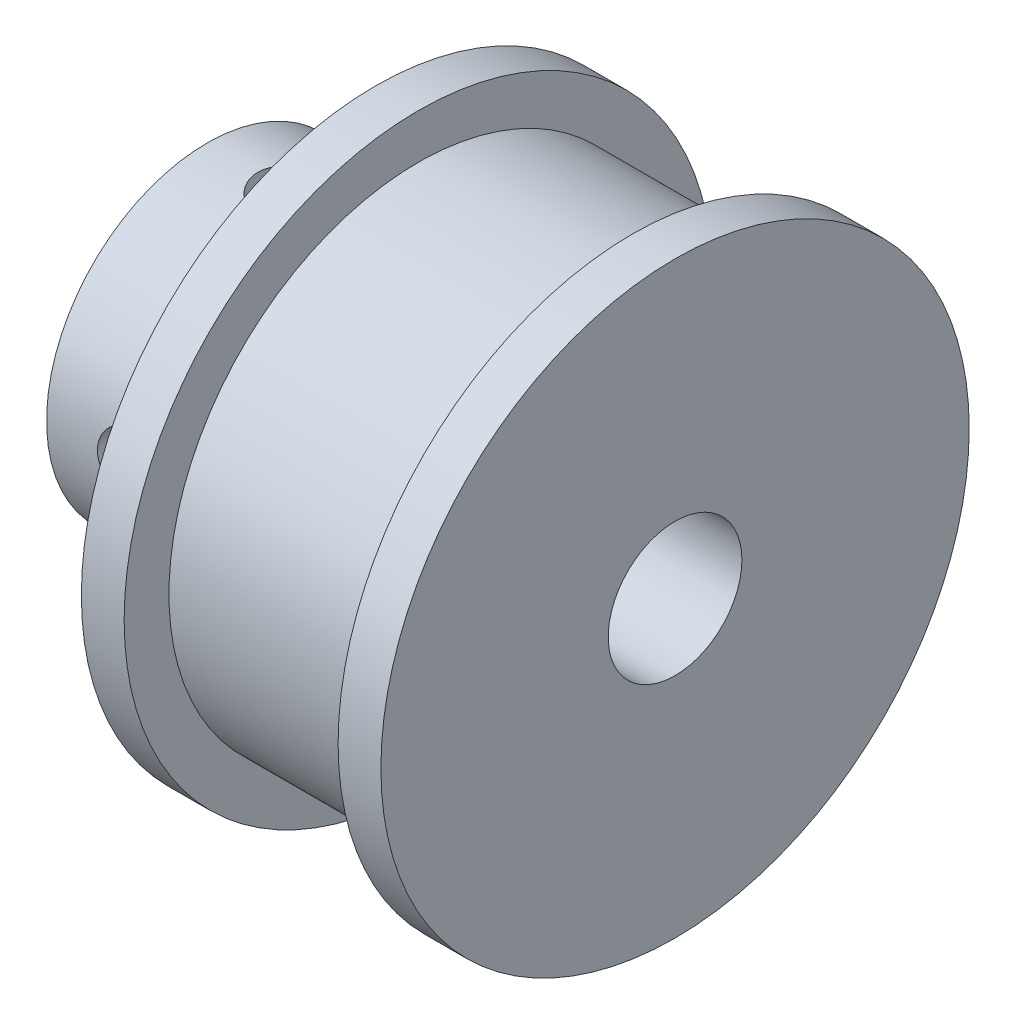
ISO-10303-21;
HEADER;
FILE_DESCRIPTION(('STEP AP214'),'2;1');
FILE_NAME('part.step','',(''),(''),'','','');
FILE_SCHEMA(('AUTOMOTIVE_DESIGN { 1 0 10303 214 1 1 1 1 }'));
ENDSEC;
DATA;
#1=APPLICATION_CONTEXT('core data for automotive mechanical design processes');
#2=APPLICATION_PROTOCOL_DEFINITION('international standard','automotive_design',2000,#1);
#3=PRODUCT_CONTEXT('',#1,'mechanical');
#4=PRODUCT('Part','Part','',(#3));
#5=PRODUCT_RELATED_PRODUCT_CATEGORY('part','',(#4));
#6=PRODUCT_DEFINITION_FORMATION('','',#4);
#7=PRODUCT_DEFINITION_CONTEXT('part definition',#1,'design');
#8=PRODUCT_DEFINITION('design','',#6,#7);
#9=PRODUCT_DEFINITION_SHAPE('','',#8);
#10=(LENGTH_UNIT() NAMED_UNIT(*) SI_UNIT(.MILLI.,.METRE.));
#11=(NAMED_UNIT(*) PLANE_ANGLE_UNIT() SI_UNIT($,.RADIAN.));
#12=(NAMED_UNIT(*) SI_UNIT($,.STERADIAN.) SOLID_ANGLE_UNIT());
#13=UNCERTAINTY_MEASURE_WITH_UNIT(LENGTH_MEASURE(1.E-05),#10,'distance_accuracy_value','');
#14=(GEOMETRIC_REPRESENTATION_CONTEXT(3) GLOBAL_UNCERTAINTY_ASSIGNED_CONTEXT((#13)) GLOBAL_UNIT_ASSIGNED_CONTEXT((#10,
#11,#12)) REPRESENTATION_CONTEXT('',''));
#15=CARTESIAN_POINT('',(0.,0.,0.));
#16=DIRECTION('',(0.,0.,1.));
#17=DIRECTION('',(1.,0.,0.));
#18=AXIS2_PLACEMENT_3D('',#15,#16,#17);
#19=CARTESIAN_POINT('',(0.,0.,0.));
#20=DIRECTION('',(1.,0.,0.));
#21=DIRECTION('',(0.,0.,-1.));
#22=AXIS2_PLACEMENT_3D('',#19,#20,#21);
#23=CYLINDRICAL_SURFACE('',#22,2.5);
#24=CARTESIAN_POINT('',(1.90000000000001,0.,2.5));
#25=CARTESIAN_POINT('',(1.90000412789938,0.0657149536912328,2.49999641755189));
#26=CARTESIAN_POINT('',(1.9052125914021,0.13150824962254,2.49738113774397));
#27=CARTESIAN_POINT('',(1.92581610042616,0.26115029408553,2.48717695046745));
#28=CARTESIAN_POINT('',(1.94123049124707,0.324995108391878,2.4795785978623));
#29=CARTESIAN_POINT('',(1.981492260771,0.448666931100716,2.4602034925414));
#30=CARTESIAN_POINT('',(2.00630298031002,0.508508503673972,2.448442989719));
#31=CARTESIAN_POINT('',(2.06446327670618,0.623090771008203,2.42182220644723));
#32=CARTESIAN_POINT('',(2.09781218031107,0.677831867487559,2.40696217041913));
#33=CARTESIAN_POINT('',(2.17439656185663,0.784384772202395,2.37445322822571));
#34=CARTESIAN_POINT('',(2.21810809904956,0.835819013902635,2.3566899890942));
#35=CARTESIAN_POINT('',(2.3131518490588,0.930974306083717,2.32074962808431));
#36=CARTESIAN_POINT('',(2.36448981471556,0.974689478883453,2.30257220261294));
#37=CARTESIAN_POINT('',(2.47810418690423,1.05656500056284,2.26623688996684));
#38=CARTESIAN_POINT('',(2.5409201229324,1.09403166943954,2.24818983712665));
#39=CARTESIAN_POINT('',(2.67295916998277,1.15771028361336,2.21607473465401));
#40=CARTESIAN_POINT('',(2.74217766090344,1.18393026870791,2.20200384508737));
#41=CARTESIAN_POINT('',(2.88083138177741,1.22266555273573,2.18072333797261));
#42=CARTESIAN_POINT('',(2.95000556508425,1.23590732135054,2.17315339479642));
#43=CARTESIAN_POINT('',(3.08997354722435,1.25053374163605,2.1647736243566));
#44=CARTESIAN_POINT('',(3.16076567608894,1.25193011046634,2.16395711679111));
#45=CARTESIAN_POINT('',(3.29285753039421,1.24335910896536,2.16888662821561));
#46=CARTESIAN_POINT('',(3.35428003902881,1.23473069942102,2.17385954577517));
#47=CARTESIAN_POINT('',(3.4746523867163,1.20867481132116,2.18845285917313));
#48=CARTESIAN_POINT('',(3.53360143163164,1.19124452987206,2.19807473539721));
#49=CARTESIAN_POINT('',(3.64903641570707,1.1477622254825,2.22109345515927));
#50=CARTESIAN_POINT('',(3.70543299848223,1.12151883389499,2.23457300829999));
#51=CARTESIAN_POINT('',(3.81329286573751,1.061302109585,2.26379255351755));
#52=CARTESIAN_POINT('',(3.86475391950011,1.02732530476558,2.27953355975239));
#53=CARTESIAN_POINT('',(3.96815156592903,0.947582568640978,2.31391447379108));
#54=CARTESIAN_POINT('',(4.01932109197019,0.900868072961595,2.33266887795933));
#55=CARTESIAN_POINT('',(4.11341927323862,0.799444473426711,2.36934529125509));
#56=CARTESIAN_POINT('',(4.15634399004235,0.744731570717851,2.38726689948501));
#57=CARTESIAN_POINT('',(4.23460707628715,0.625645632289805,2.42127484103705));
#58=CARTESIAN_POINT('',(4.26950059055717,0.560941989499256,2.43723730202509));
#59=CARTESIAN_POINT('',(4.32762128630376,0.425582769360992,2.46447351401553));
#60=CARTESIAN_POINT('',(4.35085773126895,0.354931970331592,2.47575098679441));
#61=CARTESIAN_POINT('',(4.38309425464584,0.215958114575874,2.49155417176795));
#62=CARTESIAN_POINT('',(4.39311404468347,0.147926913185403,2.4965617287664));
#63=CARTESIAN_POINT('',(4.40183091391811,0.0109744999366904,2.50091266823877));
#64=CARTESIAN_POINT('',(4.40053335704934,-0.0579462748373779,2.5002587340164));
#65=CARTESIAN_POINT('',(4.38724163947655,-0.189041214982493,2.49363990316801));
#66=CARTESIAN_POINT('',(4.37608433408746,-0.251324260062443,2.48809057110237));
#67=CARTESIAN_POINT('',(4.34470241013114,-0.373008615377396,2.47277714143524));
#68=CARTESIAN_POINT('',(4.32447679193329,-0.432409607113745,2.46301257917916));
#69=CARTESIAN_POINT('',(4.27500191695853,-0.54861076056208,2.43980314267087));
#70=CARTESIAN_POINT('',(4.24551118735398,-0.60528799625769,2.42626102212424));
#71=CARTESIAN_POINT('',(4.17861558044244,-0.713076702123649,2.39679967896386));
#72=CARTESIAN_POINT('',(4.1412073317582,-0.7641857872191,2.38087944457232));
#73=CARTESIAN_POINT('',(4.0552994683339,-0.864709611613313,2.34635276671831));
#74=CARTESIAN_POINT('',(4.00607141443304,-0.913465097280795,2.32763606060552));
#75=CARTESIAN_POINT('',(3.90009356091336,-1.00232040139155,2.29077989504843));
#76=CARTESIAN_POINT('',(3.84333860147953,-1.04241423211355,2.27264084226908));
#77=CARTESIAN_POINT('',(3.72044543224961,-1.11463489312211,2.23813990282585));
#78=CARTESIAN_POINT('',(3.65398591723925,-1.14628186984829,2.2219066207934));
#79=CARTESIAN_POINT('',(3.51561241538434,-1.19760353251725,2.19467590460158));
#80=CARTESIAN_POINT('',(3.44370559187351,-1.21729364485946,2.18367172800773));
#81=CARTESIAN_POINT('',(3.30386222142319,-1.24232710931209,2.16951876260834));
#82=CARTESIAN_POINT('',(3.2362071832137,-1.24886624550107,2.16571729325615));
#83=CARTESIAN_POINT('',(3.10069116603659,-1.25086144297598,2.16456693307719));
#84=CARTESIAN_POINT('',(3.03283028907571,-1.24632230828049,2.16721524534441));
#85=CARTESIAN_POINT('',(2.90564562308498,-1.22740765699032,2.17797327562531));
#86=CARTESIAN_POINT('',(2.8461244123195,-1.21401039292849,2.18553868102993));
#87=CARTESIAN_POINT('',(2.73023985071912,-1.1789691977808,2.20463770234897));
#88=CARTESIAN_POINT('',(2.67387752238504,-1.15732261394975,2.21617259462095));
#89=CARTESIAN_POINT('',(2.56171893626674,-1.10476968162585,2.24285662955661));
#90=CARTESIAN_POINT('',(2.50621512271288,-1.07333892227056,2.25819652995239));
#91=CARTESIAN_POINT('',(2.40090682977427,-1.00268871454578,2.29044164543238));
#92=CARTESIAN_POINT('',(2.35110533685189,-0.963465214048302,2.30734767243153));
#93=CARTESIAN_POINT('',(2.25232252205298,-0.872754158330794,2.34327903949142));
#94=CARTESIAN_POINT('',(2.2041761220476,-0.820355528762706,2.36231229139336));
#95=CARTESIAN_POINT('',(2.11717127072046,-0.707693507775342,2.3984719031886));
#96=CARTESIAN_POINT('',(2.07831782571714,-0.647425904070974,2.4155972326005));
#97=CARTESIAN_POINT('',(2.01095454654725,-0.519914496024927,2.44622511981379));
#98=CARTESIAN_POINT('',(1.98251978823571,-0.452624379918261,2.45970120703636));
#99=CARTESIAN_POINT('',(1.93773979010132,-0.313427626617733,2.48126676704332));
#100=CARTESIAN_POINT('',(1.92136019146304,-0.241534749528952,2.48937154216165));
#101=CARTESIAN_POINT('',(1.9076282361552,-0.140752433104225,2.49619327387079));
#102=CARTESIAN_POINT('',(1.90477169892048,-0.112702349299369,2.49761706674002));
#103=CARTESIAN_POINT('',(1.900956668104,-0.0564396647589448,2.49952121222331));
#104=CARTESIAN_POINT('',(1.89999822691101,-0.0282270595592256,2.50000153879704));
#105=CARTESIAN_POINT('',(1.90000000000001,0.,2.5));
#106=B_SPLINE_CURVE_WITH_KNOTS('',3,(#24,#25,#26,#27,#28,#29,#30,#31,#32,#33,#34,#35,#36,#37,
#38,#39,#40,#41,#42,#43,#44,#45,#46,#47,#48,#49,#50,#51,#52,#53,#54,#55,#56,#57,#58,#59,#60,#61,
#62,#63,#64,#65,#66,#67,#68,#69,#70,#71,#72,#73,#74,#75,#76,#77,#78,#79,#80,#81,#82,#83,#84,#85,
#86,#87,#88,#89,#90,#91,#92,#93,#94,#95,#96,#97,#98,#99,#100,#101,#102,#103,#104,#105),
.UNSPECIFIED.,.T.,.F.,(4,2,2,2,2,2,2,2,2,2,2,2,2,2,2,2,2,2,2,2,2,2,2,2,2,2,2,2,2,2,2,2,2,2,2,2,
2,2,2,2,4),(0.,0.197030321775365,0.394435187136495,0.59107769436537,0.787704700726955,
0.996227198397605,1.20490779706754,1.4297715803844,1.6544743487285,1.86572515175286,
2.07676696661274,2.26257140511649,2.44843504907097,2.63862800210608,2.82890651575276,
3.04331176667346,3.25781918248356,3.48228777768049,3.70657771140347,3.9122911308918,
4.11790705639343,4.3075863313265,4.49728652038662,4.6924107003487,4.88761813435421,
5.10199513305521,5.31651985769287,5.54143352699589,5.76605639925969,5.96911634372963,
6.17208824825003,6.35572412805224,6.53941910979594,6.73545570969514,6.93159451423693,
7.15156553440619,7.37165479220712,7.59330017078652,7.81431135781158,7.89894100172117,
7.98357298143554),.UNSPECIFIED.);
#107=CARTESIAN_POINT('',(1.90000000000001,0.,2.5));
#108=VERTEX_POINT('',#107);
#109=EDGE_CURVE('E3643',#108,#108,#106,.T.);
#110=ORIENTED_EDGE('',*,*,#109,.F.);
#111=EDGE_LOOP('',(#110));
#112=FACE_BOUND('',#111,.T.);
#113=CARTESIAN_POINT('',(3.15,2.1650635094611,-1.25));
#114=CARTESIAN_POINT('',(3.21513476024406,2.16506918410574,-1.24999545384316));
#115=CARTESIAN_POINT('',(3.28035176440631,2.16804751484696,-1.24487496341652));
#116=CARTESIAN_POINT('',(3.40878408084644,2.17952958065066,-1.22465401237257));
#117=CARTESIAN_POINT('',(3.47199489380426,2.18804492569449,-1.20953258069272));
#118=CARTESIAN_POINT('',(3.59431458042993,2.20936683256748,-1.17012493587476));
#119=CARTESIAN_POINT('',(3.65344331559198,2.22215054341565,-1.14588744061716));
#120=CARTESIAN_POINT('',(3.7667802524959,2.25053331021072,-1.08908440672046));
#121=CARTESIAN_POINT('',(3.82098818782807,2.26613251845081,-1.05651841754472));
#122=CARTESIAN_POINT('',(3.92788216069688,2.29996086321802,-0.980833175663597));
#123=CARTESIAN_POINT('',(3.98007391959193,2.31830079547442,-0.937065045179712));
#124=CARTESIAN_POINT('',(4.07676048550839,2.35464978482132,-0.841567259518084));
#125=CARTESIAN_POINT('',(4.1212514532294,2.37265867289062,-0.789833657227865));
#126=CARTESIAN_POINT('',(4.20420893893458,2.40776846191186,-0.675611954268182));
#127=CARTESIAN_POINT('',(4.24206720982441,2.42472633022716,-0.612633986265718));
#128=CARTESIAN_POINT('',(4.3064260665572,2.45438445124411,-0.480196283249379));
#129=CARTESIAN_POINT('',(4.33293382017146,2.46708738979677,-0.410740672672693));
#130=CARTESIAN_POINT('',(4.37188082662637,2.48600576555297,-0.272556179907471));
#131=CARTESIAN_POINT('',(4.38518690794442,2.49261850276115,-0.204127238111022));
#132=CARTESIAN_POINT('',(4.4002076483438,2.50009479807584,-0.0657132858723104));
#133=CARTESIAN_POINT('',(4.40192932099464,2.50096183480737,0.00427075730467285));
#134=CARTESIAN_POINT('',(4.39406665753706,2.49703727395563,0.137290655529687));
#135=CARTESIAN_POINT('',(4.38545248059847,2.49273119865201,0.200401498970989));
#136=CARTESIAN_POINT('',(4.35889894511918,2.47967806574684,0.324142214897902));
#137=CARTESIAN_POINT('',(4.34095888877972,2.47093067582992,0.384771901367406));
#138=CARTESIAN_POINT('',(4.29614679238773,2.44964479109568,0.502886739461941));
#139=CARTESIAN_POINT('',(4.26915460853492,2.43705551911499,0.560316779393972));
#140=CARTESIAN_POINT('',(4.20717072974813,2.40922057483359,0.66997100189166));
#141=CARTESIAN_POINT('',(4.17217617087206,2.39397395196855,0.722193311048306));
#142=CARTESIAN_POINT('',(4.09138081058373,2.36055492999037,0.825217076122743));
#143=CARTESIAN_POINT('',(4.04487121459249,2.34224219997719,0.8754175937867));
#144=CARTESIAN_POINT('',(3.94426284383728,2.30567925733515,0.967630462872224));
#145=CARTESIAN_POINT('',(3.89015828465742,2.28742910332036,1.00963651446779));
#146=CARTESIAN_POINT('',(3.77168975946989,2.25180195115606,1.08688166830276));
#147=CARTESIAN_POINT('',(3.70689247118224,2.23455399988385,1.12152164372256));
#148=CARTESIAN_POINT('',(3.57132791080125,2.2046931284822,1.17914889125154));
#149=CARTESIAN_POINT('',(3.50056695872805,2.19207537557584,1.20214832276361));
#150=CARTESIAN_POINT('',(3.36098186089651,2.17430794771293,1.2339752637813));
#151=CARTESIAN_POINT('',(3.29244860119556,2.16864569810621,1.24378140264997));
#152=CARTESIAN_POINT('',(3.15449832310432,2.16397399202012,1.25189618326428));
#153=CARTESIAN_POINT('',(3.08508196360027,2.1649598361164,1.25021294664378));
#154=CARTESIAN_POINT('',(2.95543260177659,2.17292920675731,1.23629505417996));
#155=CARTESIAN_POINT('',(2.89502568611509,2.17924484383318,1.22523477089058));
#156=CARTESIAN_POINT('',(2.7770402671613,2.19617526939177,1.19462035579055));
#157=CARTESIAN_POINT('',(2.71946268656674,2.20679145006292,1.17506347327952));
#158=CARTESIAN_POINT('',(2.60573583637163,2.23170277599571,1.12705948575611));
#159=CARTESIAN_POINT('',(2.54977622893306,2.24614554053829,1.0982425796159));
#160=CARTESIAN_POINT('',(2.44316341057626,2.27695149371562,1.03285883001975));
#161=CARTESIAN_POINT('',(2.3925129456084,2.29331566693935,0.996288005415269));
#162=CARTESIAN_POINT('',(2.29127654059557,2.3285999807042,0.911046458998566));
#163=CARTESIAN_POINT('',(2.24150356160293,2.34758228942861,0.861431590393707));
#164=CARTESIAN_POINT('',(2.15073470250801,2.38417793722366,0.754255619247859));
#165=CARTESIAN_POINT('',(2.10974178721183,2.40179081259637,0.696691843319182));
#166=CARTESIAN_POINT('',(2.03678284256238,2.43426702113696,0.573169203198445));
#167=CARTESIAN_POINT('',(2.00508360223636,2.44904552090037,0.50702887196764));
#168=CARTESIAN_POINT('',(1.95357762017826,2.47354193699126,0.369402955801352));
#169=CARTESIAN_POINT('',(1.93376043579212,2.48326429595466,0.297922126740219));
#170=CARTESIAN_POINT('',(1.90828929478168,2.49584385227353,0.158724602913021));
#171=CARTESIAN_POINT('',(1.90150265515486,2.49924909885239,0.0912643048130704));
#172=CARTESIAN_POINT('',(1.898945918182,2.50052662968914,-0.0439074824390051));
#173=CARTESIAN_POINT('',(1.90317196434555,2.49840085083612,-0.111618875368859));
#174=CARTESIAN_POINT('',(1.92177050849453,2.48917461047403,-0.240672490396434));
#175=CARTESIAN_POINT('',(1.93545606157209,2.48241118334987,-0.30214039726408));
#176=CARTESIAN_POINT('',(1.97165874912872,2.46490117079279,-0.421807440229522));
#177=CARTESIAN_POINT('',(1.99417715011682,2.45415401415995,-0.480006106194386));
#178=CARTESIAN_POINT('',(2.04840881520747,2.4290741343515,-0.594279257806106));
#179=CARTESIAN_POINT('',(2.0804741540098,2.41460771498499,-0.650156428375058));
#180=CARTESIAN_POINT('',(2.15244741357382,2.38360166427283,-0.755968302267531));
#181=CARTESIAN_POINT('',(2.19235893639459,2.36706108197951,-0.805900259268634));
#182=CARTESIAN_POINT('',(2.28349642377838,2.33160762783285,-0.903642505196113));
#183=CARTESIAN_POINT('',(2.33545310934649,2.31262248764622,-0.950747105674089));
#184=CARTESIAN_POINT('',(2.44681340141222,2.27578845203566,-1.03582910924334));
#185=CARTESIAN_POINT('',(2.50622352608461,2.25794057202332,-1.07379843751257));
#186=CARTESIAN_POINT('',(2.6332958082262,2.22499506631145,-1.14053884973207));
#187=CARTESIAN_POINT('',(2.70115941391092,2.21000217820338,-1.16898133245117));
#188=CARTESIAN_POINT('',(2.84166550542472,2.1858269541044,-1.21359838688301));
#189=CARTESIAN_POINT('',(2.91429111114086,2.17662520184628,-1.22981398896918));
#190=CARTESIAN_POINT('',(3.014756694565,2.16911590752238,-1.24295875983052));
#191=CARTESIAN_POINT('',(3.04170986799736,2.1676016125644,-1.24559513120481));
#192=CARTESIAN_POINT('',(3.09577060085281,2.16557419859688,-1.24911675636245));
#193=CARTESIAN_POINT('',(3.12287817048234,2.16506114656387,-1.25000189299984));
#194=CARTESIAN_POINT('',(3.15,2.1650635094611,-1.25));
#195=B_SPLINE_CURVE_WITH_KNOTS('',3,(#113,#114,#115,#116,#117,#118,#119,#120,#121,#122,#123,
#124,#125,#126,#127,#128,#129,#130,#131,#132,#133,#134,#135,#136,#137,#138,#139,#140,#141,#142,
#143,#144,#145,#146,#147,#148,#149,#150,#151,#152,#153,#154,#155,#156,#157,#158,#159,#160,#161,
#162,#163,#164,#165,#166,#167,#168,#169,#170,#171,#172,#173,#174,#175,#176,#177,#178,#179,#180,
#181,#182,#183,#184,#185,#186,#187,#188,#189,#190,#191,#192,#193,#194),.UNSPECIFIED.,.T.,.F.,(4,
2,2,2,2,2,2,2,2,2,2,2,2,2,2,2,2,2,2,2,2,2,2,2,2,2,2,2,2,2,2,2,2,2,2,2,2,2,2,2,4),(0.,
0.195290153243394,0.390991116031006,0.585660744898607,0.780340906806436,0.991077890622791,
1.20191963855464,1.42697365298454,1.65188533704864,1.86079356209919,2.0695752960755,
2.26020121855673,2.45084140646819,2.64411918413933,2.83746624187839,3.04908989321113,
3.26087560307398,3.4861105216181,3.71110967764631,3.91827863567764,4.12530116485466,
4.30967729280031,4.49411315545078,4.68709120507609,4.88016857775059,5.09758429475766,
5.31507331222752,5.53830226766207,5.76133474760964,5.96390337986858,6.16640108492464,
6.35555531089365,6.54473666890015,6.74200938399339,6.93937287625898,7.15637802312583,
7.37357428556442,7.59763436298255,7.82093916253449,7.90225168981636,7.98356965618175),.UNSPECIFIED.);
#196=CARTESIAN_POINT('',(3.15,2.1650635094611,-1.25));
#197=VERTEX_POINT('',#196);
#198=EDGE_CURVE('E3642',#197,#197,#195,.T.);
#199=ORIENTED_EDGE('',*,*,#198,.F.);
#200=EDGE_LOOP('',(#199));
#201=FACE_BOUND('',#200,.T.);
#202=CARTESIAN_POINT('',(17.5,0.,0.));
#203=DIRECTION('',(1.,0.,0.));
#204=DIRECTION('',(0.,0.,-1.));
#205=AXIS2_PLACEMENT_3D('',#202,#203,#204);
#206=CIRCLE('',#205,2.5);
#207=CARTESIAN_POINT('',(17.5,0.,-2.5));
#208=VERTEX_POINT('',#207);
#209=EDGE_CURVE('E3664',#208,#208,#206,.T.);
#210=ORIENTED_EDGE('',*,*,#209,.T.);
#211=EDGE_LOOP('',(#210));
#212=FACE_BOUND('',#211,.T.);
#213=CARTESIAN_POINT('',(0.,0.,0.));
#214=DIRECTION('',(1.,0.,0.));
#215=DIRECTION('',(0.,0.,-1.));
#216=AXIS2_PLACEMENT_3D('',#213,#214,#215);
#217=CIRCLE('',#216,2.5);
#218=CARTESIAN_POINT('',(0.,0.,-2.5));
#219=VERTEX_POINT('',#218);
#220=EDGE_CURVE('E12',#219,#219,#217,.T.);
#221=ORIENTED_EDGE('',*,*,#220,.F.);
#222=EDGE_LOOP('',(#221));
#223=FACE_BOUND('',#222,.T.);
#224=ADVANCED_FACE('F3615',(#112,#201,#212,#223),#23,.F.);
#225=CARTESIAN_POINT('',(0.,2.5,0.));
#226=DIRECTION('',(-1.,0.,0.));
#227=DIRECTION('',(0.,0.,1.));
#228=AXIS2_PLACEMENT_3D('',#225,#226,#227);
#229=PLANE('',#228);
#230=ORIENTED_EDGE('',*,*,#220,.T.);
#231=EDGE_LOOP('',(#230));
#232=FACE_BOUND('',#231,.T.);
#233=CARTESIAN_POINT('',(0.,0.,0.));
#234=DIRECTION('',(1.,0.,0.));
#235=DIRECTION('',(0.,0.,-1.));
#236=AXIS2_PLACEMENT_3D('',#233,#234,#235);
#237=CIRCLE('',#236,6.);
#238=CARTESIAN_POINT('',(0.,0.,-6.));
#239=VERTEX_POINT('',#238);
#240=EDGE_CURVE('E3628',#239,#239,#237,.T.);
#241=ORIENTED_EDGE('',*,*,#240,.F.);
#242=EDGE_LOOP('',(#241));
#243=FACE_BOUND('',#242,.T.);
#244=ADVANCED_FACE('F3694',(#232,#243),#229,.T.);
#245=CARTESIAN_POINT('',(0.,0.,0.));
#246=DIRECTION('',(1.,0.,0.));
#247=DIRECTION('',(0.,0.,-1.));
#248=AXIS2_PLACEMENT_3D('',#245,#246,#247);
#249=CYLINDRICAL_SURFACE('',#248,6.);
#250=CARTESIAN_POINT('',(1.90000000000001,0.,6.));
#251=CARTESIAN_POINT('',(1.90000247746923,-0.0694090417016603,5.99999871526651));
#252=CARTESIAN_POINT('',(1.90580066571876,-0.138848789520875,5.99878328775043));
#253=CARTESIAN_POINT('',(1.92881934953286,-0.275761316266992,5.99405200990679));
#254=CARTESIAN_POINT('',(1.94604852303694,-0.343232560128311,5.99053441189248));
#255=CARTESIAN_POINT('',(1.99137045492183,-0.474209132291339,5.98159109196202));
#256=CARTESIAN_POINT('',(2.01945239599889,-0.537718336709182,5.97616727052645));
#257=CARTESIAN_POINT('',(2.08564960885619,-0.659120328605954,5.96399927809859));
#258=CARTESIAN_POINT('',(2.12376443115584,-0.717013367534323,5.95725516625975));
#259=CARTESIAN_POINT('',(2.20953634019065,-0.826390324308832,5.9430770002465));
#260=CARTESIAN_POINT('',(2.25731200123509,-0.87778024416268,5.93563505848531));
#261=CARTESIAN_POINT('',(2.36079465919511,-0.971877776769387,5.92095657692448));
#262=CARTESIAN_POINT('',(2.41650231187227,-1.01458467096098,5.91372005416683));
#263=CARTESIAN_POINT('',(2.53495196876616,-1.09051031677216,5.90019442595308));
#264=CARTESIAN_POINT('',(2.59775838450275,-1.1236305468065,5.89391545174828));
#265=CARTESIAN_POINT('',(2.72819745177276,-1.17881119348063,5.8831284065002));
#266=CARTESIAN_POINT('',(2.79582958244254,-1.20087280167641,5.87862014467568));
#267=CARTESIAN_POINT('',(2.93298523741564,-1.23300240133736,5.87196500986123));
#268=CARTESIAN_POINT('',(3.00246835933477,-1.24323597696798,5.86978556855865));
#269=CARTESIAN_POINT('',(3.14219684286263,-1.25193357655614,5.86793690716491));
#270=CARTESIAN_POINT('',(3.2124421188653,-1.25039890894686,5.86826740800981));
#271=CARTESIAN_POINT('',(3.35048102797518,-1.23573719037196,5.87137174319175));
#272=CARTESIAN_POINT('',(3.41829597966121,-1.2228010523272,5.87410533679901));
#273=CARTESIAN_POINT('',(3.55077150964493,-1.18600543529945,5.88164437615942));
#274=CARTESIAN_POINT('',(3.61543192560633,-1.16214539481381,5.88644992841317));
#275=CARTESIAN_POINT('',(3.74030722841598,-1.10400003213928,5.89763191464102));
#276=CARTESIAN_POINT('',(3.80048629652707,-1.06964002534236,5.90401953785586));
#277=CARTESIAN_POINT('',(3.91429574426816,-0.991522699274812,5.91763890010721));
#278=CARTESIAN_POINT('',(3.96792530883597,-0.947764212262582,5.92487074398537));
#279=CARTESIAN_POINT('',(4.06821396108037,-0.851074921546777,5.93953730929909));
#280=CARTESIAN_POINT('',(4.11471616889701,-0.797981433412077,5.94697323199473));
#281=CARTESIAN_POINT('',(4.19818044222897,-0.684667288611794,5.96108088143001));
#282=CARTESIAN_POINT('',(4.23514236459839,-0.624446525025762,5.96775259670236));
#283=CARTESIAN_POINT('',(4.29851008153595,-0.498405541235475,5.97959870942815));
#284=CARTESIAN_POINT('',(4.32489680456711,-0.432575461926497,5.98477039710258));
#285=CARTESIAN_POINT('',(4.36619170483549,-0.297284620972153,5.99301338211281));
#286=CARTESIAN_POINT('',(4.38110139323139,-0.227824338595088,5.99608495596053));
#287=CARTESIAN_POINT('',(4.39879425206788,-0.0885918657008349,5.99974275215455));
#288=CARTESIAN_POINT('',(4.40179194149424,-0.0188480555261788,6.00037293537579));
#289=CARTESIAN_POINT('',(4.39615505003089,0.120143798757714,5.99919952252774));
#290=CARTESIAN_POINT('',(4.3875211813984,0.189391872962257,5.99739607548153));
#291=CARTESIAN_POINT('',(4.35904434653046,0.324726367119811,5.99158564979184));
#292=CARTESIAN_POINT('',(4.33931251461653,0.390837192894204,5.98760052868077));
#293=CARTESIAN_POINT('',(4.28932213957859,0.518811446661328,5.97787227242395));
#294=CARTESIAN_POINT('',(4.25906275913401,0.580674536336772,5.97212899744579));
#295=CARTESIAN_POINT('',(4.18841962176244,0.69929430694349,5.95941241490714));
#296=CARTESIAN_POINT('',(4.14790807043093,0.755973219469829,5.9524239381233));
#297=CARTESIAN_POINT('',(4.05808043692373,0.861805445886515,5.93802568299709));
#298=CARTESIAN_POINT('',(4.00876332448106,0.910957877913281,5.93061585542511));
#299=CARTESIAN_POINT('',(3.9017444230003,1.0011786486518,5.91606024531377));
#300=CARTESIAN_POINT('',(3.84391696804472,1.04209914600204,5.90892089307501));
#301=CARTESIAN_POINT('',(3.72208371578621,1.11364719079243,5.89585601015805));
#302=CARTESIAN_POINT('',(3.65807817586089,1.14427516677863,5.88993042894651));
#303=CARTESIAN_POINT('',(3.52603880370177,1.19417246443921,5.88001700708041));
#304=CARTESIAN_POINT('',(3.45802896283416,1.21350309828031,5.87601872784687));
#305=CARTESIAN_POINT('',(3.31963344950774,1.24044038523407,5.87039184709697));
#306=CARTESIAN_POINT('',(3.24924811838056,1.2480487154444,5.86876290660367));
#307=CARTESIAN_POINT('',(3.10958659900035,1.25125926487611,5.86807907308506));
#308=CARTESIAN_POINT('',(3.04031592977795,1.24709542622725,5.86897402321502));
#309=CARTESIAN_POINT('',(2.90348599107978,1.22739905314031,5.87312447254928));
#310=CARTESIAN_POINT('',(2.8359267051839,1.21186662782265,5.87637994909626));
#311=CARTESIAN_POINT('',(2.70460222810934,1.16998217768584,5.88486132447716));
#312=CARTESIAN_POINT('',(2.64082675351308,1.14366117568421,5.8900815700793));
#313=CARTESIAN_POINT('',(2.51856122397334,1.08097457299757,5.90190705738738));
#314=CARTESIAN_POINT('',(2.46007166036688,1.04460803983029,5.9085124276546));
#315=CARTESIAN_POINT('',(2.34887837292056,0.962073695342405,5.92251579551146));
#316=CARTESIAN_POINT('',(2.29630087543502,0.91573789041822,5.92992613868404));
#317=CARTESIAN_POINT('',(2.19959050677365,0.814924438115329,5.94461839583213));
#318=CARTESIAN_POINT('',(2.15545958244852,0.760444918832963,5.9519002798488));
#319=CARTESIAN_POINT('',(2.07641142681595,0.644134427507699,5.96561444547637));
#320=CARTESIAN_POINT('',(2.04160632011372,0.582225921521345,5.97203596073244));
#321=CARTESIAN_POINT('',(1.98294977156998,0.453319843998451,5.98319908494092));
#322=CARTESIAN_POINT('',(1.95908875281813,0.386326781907242,5.98794216182101));
#323=CARTESIAN_POINT('',(1.92745972171158,0.266015292900104,5.99432499781443));
#324=CARTESIAN_POINT('',(1.91718123679115,0.213367593727928,5.99644035661395));
#325=CARTESIAN_POINT('',(1.90345054572268,0.107152674176536,5.99927832789758));
#326=CARTESIAN_POINT('',(1.89999808733282,0.0535854878488715,6.00000099184586));
#327=CARTESIAN_POINT('',(1.90000000000001,0.,6.));
#328=B_SPLINE_CURVE_WITH_KNOTS('',3,(#250,#251,#252,#253,#254,#255,#256,#257,#258,#259,#260,
#261,#262,#263,#264,#265,#266,#267,#268,#269,#270,#271,#272,#273,#274,#275,#276,#277,#278,#279,
#280,#281,#282,#283,#284,#285,#286,#287,#288,#289,#290,#291,#292,#293,#294,#295,#296,#297,#298,
#299,#300,#301,#302,#303,#304,#305,#306,#307,#308,#309,#310,#311,#312,#313,#314,#315,#316,#317,
#318,#319,#320,#321,#322,#323,#324,#325,#326,#327),.UNSPECIFIED.,.T.,.F.,(4,2,2,2,2,2,2,2,2,2,2,
2,2,2,2,2,2,2,2,2,2,2,2,2,2,2,2,2,2,2,2,2,2,2,2,2,2,2,4),(0.,0.208031045103182,
0.416220199906223,0.624202378825439,0.832175241572985,1.04287526388122,1.25359271551785,
1.46640449178548,1.67919333285489,1.88896575169853,2.09871484767163,2.30501712129058,
2.51133000030278,2.71914592416748,2.92698768368033,3.13889526355464,3.35080602278216,
3.5630972449966,3.77536051045769,3.98378339407673,4.19219351552275,4.39855286632619,
4.60492863390931,4.81401583995734,5.02312752564571,5.23571263829333,5.44828889851306,
5.65970050095022,5.87108185414182,6.07829223291035,6.28550062281358,6.49211731393252,
6.69875319081476,6.90919024830305,7.11967575117366,7.33258864398252,7.54531486464969,
7.70592588477276,7.86653096973387),.UNSPECIFIED.);
#329=CARTESIAN_POINT('',(1.90000000000001,0.,6.));
#330=VERTEX_POINT('',#329);
#331=EDGE_CURVE('E3619',#330,#330,#328,.T.);
#332=ORIENTED_EDGE('',*,*,#331,.F.);
#333=EDGE_LOOP('',(#332));
#334=FACE_BOUND('',#333,.T.);
#335=CARTESIAN_POINT('',(3.15,5.86834729715275,-1.25));
#336=CARTESIAN_POINT('',(3.08060938484897,5.86834869213645,-1.24999750877599));
#337=CARTESIAN_POINT('',(3.01118802798478,5.86959145924544,-1.24420229433948));
#338=CARTESIAN_POINT('',(2.87431368268275,5.87442015581798,-1.22119649233779));
#339=CARTESIAN_POINT('',(2.80686224449358,5.87800788138388,-1.20397715440342));
#340=CARTESIAN_POINT('',(2.67592762716513,5.8871029296193,-1.1586839750723));
#341=CARTESIAN_POINT('',(2.6124404040082,5.89260825706945,-1.13062141248932));
#342=CARTESIAN_POINT('',(2.4910755003544,5.90491581335741,-1.06446988601732));
#343=CARTESIAN_POINT('',(2.43319759326998,5.91171798977622,-1.0263813273582));
#344=CARTESIAN_POINT('',(2.32380462484654,5.92596934661468,-0.940636399466082));
#345=CARTESIAN_POINT('',(2.27238810637353,5.93342614373039,-0.892855554869668));
#346=CARTESIAN_POINT('',(2.1782389313519,5.94807966802575,-0.789351223880636));
#347=CARTESIAN_POINT('',(2.13550691170856,5.95527637609915,-0.733627155456002));
#348=CARTESIAN_POINT('',(2.05955411191714,5.96868135118848,-0.615162052999588));
#349=CARTESIAN_POINT('',(2.02642747353674,5.97487958631242,-0.552359428204941));
#350=CARTESIAN_POINT('',(1.97123394714022,5.98550347343302,-0.421928551006719));
#351=CARTESIAN_POINT('',(1.94916593484647,5.98992930561222,-0.354300789950591));
#352=CARTESIAN_POINT('',(1.91702423888253,5.99645589892179,-0.217162904200502));
#353=CARTESIAN_POINT('',(1.90678398280484,5.99858891959926,-0.147693380916357));
#354=CARTESIAN_POINT('',(1.89806830424298,6.00040112580612,-0.00799184883952432));
#355=CARTESIAN_POINT('',(1.8995916558069,6.0000805670369,0.0622400797368385));
#356=CARTESIAN_POINT('',(1.91423460095674,5.99704658090511,0.200326586199572));
#357=CARTESIAN_POINT('',(1.92717471895812,5.99437018956584,0.268201128726475));
#358=CARTESIAN_POINT('',(1.96399862533131,5.98696720898885,0.400793746289752));
#359=CARTESIAN_POINT('',(1.98788287720308,5.98224053291904,0.465511687511022));
#360=CARTESIAN_POINT('',(2.0460800521255,5.97120767323924,0.590460005384683));
#361=CARTESIAN_POINT('',(2.08046229420966,5.96489104125346,0.65065713498165));
#362=CARTESIAN_POINT('',(2.15862800284042,5.95137300440189,0.764493456510647));
#363=CARTESIAN_POINT('',(2.20241263820613,5.94417148958325,0.818131831816418));
#364=CARTESIAN_POINT('',(2.29912162489106,5.92951700233276,0.918394203276912));
#365=CARTESIAN_POINT('',(2.35220305998195,5.92206184975925,0.964866487494794));
#366=CARTESIAN_POINT('',(2.4654820489948,5.90786872648996,1.04827597240488));
#367=CARTESIAN_POINT('',(2.52567976138724,5.9011307717716,1.0852129606998));
#368=CARTESIAN_POINT('',(2.6517122548288,5.88912998409156,1.14856217138454));
#369=CARTESIAN_POINT('',(2.71756065069343,5.88387085232125,1.17494805489727));
#370=CARTESIAN_POINT('',(2.85289161936939,5.8754760641036,1.21623577538673));
#371=CARTESIAN_POINT('',(2.92237367280809,5.87234010507182,1.23113924882349));
#372=CARTESIAN_POINT('',(3.06161970631891,5.86860783239132,1.24880863867017));
#373=CARTESIAN_POINT('',(3.13135458453703,5.86796551863474,1.25179442917998));
#374=CARTESIAN_POINT('',(3.27032581154014,5.86916952018704,1.24613693439294));
#375=CARTESIAN_POINT('',(3.33956219090234,5.87101568152623,1.23749436857863));
#376=CARTESIAN_POINT('',(3.47482051605812,5.87694538226166,1.20901558325484));
#377=CARTESIAN_POINT('',(3.54086866717883,5.88100511282998,1.18929841376871));
#378=CARTESIAN_POINT('',(3.6687239894416,5.8908833850312,1.13935810860919));
#379=CARTESIAN_POINT('',(3.7305307856504,5.89670208191057,1.10913404556146));
#380=CARTESIAN_POINT('',(3.84910644121623,5.90954501937191,1.03854598181485));
#381=CARTESIAN_POINT('',(3.90579220446617,5.91658506648323,0.998045327353962));
#382=CARTESIAN_POINT('',(4.01164324915506,5.93103483993908,0.908234440569878));
#383=CARTESIAN_POINT('',(4.06080768623923,5.93844460766532,0.858923220505172));
#384=CARTESIAN_POINT('',(4.15106271309716,5.95294924316736,0.751900450843339));
#385=CARTESIAN_POINT('',(4.19200409502638,5.9600367471991,0.694061907614551));
#386=CARTESIAN_POINT('',(4.26358875208798,5.97296708772407,0.57220010221636));
#387=CARTESIAN_POINT('',(4.29423248223745,5.97880997920818,0.508177113476881));
#388=CARTESIAN_POINT('',(4.34413867931735,5.98856148270679,0.376142117847919));
#389=CARTESIAN_POINT('',(4.36346916554434,5.99248163136497,0.308156710970195));
#390=CARTESIAN_POINT('',(4.3904144040081,5.99799561410226,0.169813400503473));
#391=CARTESIAN_POINT('',(4.39803069353274,5.99958975342889,0.0994558094616958));
#392=CARTESIAN_POINT('',(4.40126762204851,6.00026408056941,-0.0402133434703387));
#393=CARTESIAN_POINT('',(4.39711189999473,5.99939113754811,-0.109519592177922));
#394=CARTESIAN_POINT('',(4.37741936134707,5.99532874094472,-0.246422870373552));
#395=CARTESIAN_POINT('',(4.36188271359323,5.99213932172839,-0.314019925202702));
#396=CARTESIAN_POINT('',(4.31997220535144,5.98380460077544,-0.445431965492052));
#397=CARTESIAN_POINT('',(4.29362733614689,5.97866453407556,-0.509256550004524));
#398=CARTESIAN_POINT('',(4.230877602268,5.96697995347704,-0.631610567220741));
#399=CARTESIAN_POINT('',(4.19447186165686,5.96043531730246,-0.690139538279511));
#400=CARTESIAN_POINT('',(4.11189033200669,5.94651596786386,-0.80134032129826));
#401=CARTESIAN_POINT('',(4.0655557119433,5.93912880302851,-0.853892633615926));
#402=CARTESIAN_POINT('',(3.96475549900292,5.9244278681135,-0.950552741980385));
#403=CARTESIAN_POINT('',(3.91028797005157,5.91711411595368,-0.994658521571232));
#404=CARTESIAN_POINT('',(3.79399089756656,5.90329191643327,-1.07367451852767));
#405=CARTESIAN_POINT('',(3.73208158853791,5.89679406702551,-1.10846928126994));
#406=CARTESIAN_POINT('',(3.60317484391674,5.88547039658063,-1.16710627925306));
#407=CARTESIAN_POINT('',(3.53618195154699,5.88064310352601,-1.1909581629246));
#408=CARTESIAN_POINT('',(3.41589371843157,5.87414004405196,-1.22256554131861));
#409=CARTESIAN_POINT('',(3.36327046340695,5.87198163591589,-1.2328344900567));
#410=CARTESIAN_POINT('',(3.25710421947899,5.86908475266778,-1.24655254358404));
#411=CARTESIAN_POINT('',(3.20356126768996,5.86834622039193,-1.25000192292741));
#412=CARTESIAN_POINT('',(3.15,5.86834729715275,-1.25));
#413=B_SPLINE_CURVE_WITH_KNOTS('',3,(#335,#336,#337,#338,#339,#340,#341,#342,#343,#344,#345,
#346,#347,#348,#349,#350,#351,#352,#353,#354,#355,#356,#357,#358,#359,#360,#361,#362,#363,#364,
#365,#366,#367,#368,#369,#370,#371,#372,#373,#374,#375,#376,#377,#378,#379,#380,#381,#382,#383,
#384,#385,#386,#387,#388,#389,#390,#391,#392,#393,#394,#395,#396,#397,#398,#399,#400,#401,#402,
#403,#404,#405,#406,#407,#408,#409,#410,#411,#412),.UNSPECIFIED.,.T.,.F.,(4,2,2,2,2,2,2,2,2,2,2,
2,2,2,2,2,2,2,2,2,2,2,2,2,2,2,2,2,2,2,2,2,2,2,2,2,2,2,4),(0.,0.207975654071269,0.41611079241747,
0.624030014802729,0.831940834815791,1.04271333467885,1.25350128663874,1.46629026266844,
1.67905760106933,1.88879048859264,2.09850151896339,2.30497341416461,2.5114540545587,
2.71932871977949,2.9272292410426,3.13905862244913,3.35089272191628,3.56325237332487,
3.77558175387597,3.98397516009792,4.19235567296524,4.39853786231922,4.60473825464031,
4.81383917934651,5.02296356082185,5.23559458753343,5.4482162175904,5.65954599648534,
5.87084803959581,6.07816293922644,6.28547476332981,6.492234105851,6.69901145528173,
6.90938318978573,7.11980508427535,7.33272651358123,7.54545984571988,7.70599867585769,
7.8665310426116),.UNSPECIFIED.);
#414=CARTESIAN_POINT('',(3.15,5.86834729715275,-1.25));
#415=VERTEX_POINT('',#414);
#416=EDGE_CURVE('E3636',#415,#415,#413,.T.);
#417=ORIENTED_EDGE('',*,*,#416,.F.);
#418=EDGE_LOOP('',(#417));
#419=FACE_BOUND('',#418,.T.);
#420=ORIENTED_EDGE('',*,*,#240,.T.);
#421=EDGE_LOOP('',(#420));
#422=FACE_BOUND('',#421,.T.);
#423=CARTESIAN_POINT('',(6.3,0.,0.));
#424=DIRECTION('',(1.,0.,0.));
#425=DIRECTION('',(0.,0.,-1.));
#426=AXIS2_PLACEMENT_3D('',#423,#424,#425);
#427=CIRCLE('',#426,6.);
#428=CARTESIAN_POINT('',(6.3,0.,-6.));
#429=VERTEX_POINT('',#428);
#430=EDGE_CURVE('E3633',#429,#429,#427,.T.);
#431=ORIENTED_EDGE('',*,*,#430,.F.);
#432=EDGE_LOOP('',(#431));
#433=FACE_BOUND('',#432,.T.);
#434=ADVANCED_FACE('F3644',(#334,#419,#422,#433),#249,.T.);
#435=CARTESIAN_POINT('',(6.3,11.,0.));
#436=DIRECTION('',(-1.,0.,0.));
#437=DIRECTION('',(0.,0.,1.));
#438=AXIS2_PLACEMENT_3D('',#435,#436,#437);
#439=PLANE('',#438);
#440=ORIENTED_EDGE('',*,*,#430,.T.);
#441=EDGE_LOOP('',(#440));
#442=FACE_BOUND('',#441,.T.);
#443=CARTESIAN_POINT('',(6.3,0.,0.));
#444=DIRECTION('',(1.,0.,0.));
#445=DIRECTION('',(0.,0.,-1.));
#446=AXIS2_PLACEMENT_3D('',#443,#444,#445);
#447=CIRCLE('',#446,11.);
#448=CARTESIAN_POINT('',(6.3,0.,-11.));
#449=VERTEX_POINT('',#448);
#450=EDGE_CURVE('E3685',#449,#449,#447,.T.);
#451=ORIENTED_EDGE('',*,*,#450,.F.);
#452=EDGE_LOOP('',(#451));
#453=FACE_BOUND('',#452,.T.);
#454=ADVANCED_FACE('F3690',(#442,#453),#439,.T.);
#455=CARTESIAN_POINT('',(0.,0.,0.));
#456=DIRECTION('',(1.,0.,0.));
#457=DIRECTION('',(0.,0.,-1.));
#458=AXIS2_PLACEMENT_3D('',#455,#456,#457);
#459=CYLINDRICAL_SURFACE('',#458,11.);
#460=ORIENTED_EDGE('',*,*,#450,.T.);
#461=EDGE_LOOP('',(#460));
#462=FACE_BOUND('',#461,.T.);
#463=CARTESIAN_POINT('',(7.9,0.,0.));
#464=DIRECTION('',(1.,0.,0.));
#465=DIRECTION('',(0.,0.,-1.));
#466=AXIS2_PLACEMENT_3D('',#463,#464,#465);
#467=CIRCLE('',#466,11.);
#468=CARTESIAN_POINT('',(7.9,0.,-11.));
#469=VERTEX_POINT('',#468);
#470=EDGE_CURVE('E3682',#469,#469,#467,.T.);
#471=ORIENTED_EDGE('',*,*,#470,.F.);
#472=EDGE_LOOP('',(#471));
#473=FACE_BOUND('',#472,.T.);
#474=ADVANCED_FACE('F3701',(#462,#473),#459,.T.);
#475=CARTESIAN_POINT('',(7.9,11.,0.));
#476=DIRECTION('',(1.,0.,0.));
#477=DIRECTION('',(0.,0.,-1.));
#478=AXIS2_PLACEMENT_3D('',#475,#476,#477);
#479=PLANE('',#478);
#480=ORIENTED_EDGE('',*,*,#470,.T.);
#481=EDGE_LOOP('',(#480));
#482=FACE_BOUND('',#481,.T.);
#483=CARTESIAN_POINT('',(7.9,0.,0.));
#484=DIRECTION('',(1.,0.,0.));
#485=DIRECTION('',(0.,0.,-1.));
#486=AXIS2_PLACEMENT_3D('',#483,#484,#485);
#487=CIRCLE('',#486,9.325);
#488=CARTESIAN_POINT('',(7.9,0.,-9.325));
#489=VERTEX_POINT('',#488);
#490=EDGE_CURVE('E3679',#489,#489,#487,.T.);
#491=ORIENTED_EDGE('',*,*,#490,.F.);
#492=EDGE_LOOP('',(#491));
#493=FACE_BOUND('',#492,.T.);
#494=ADVANCED_FACE('F3735',(#482,#493),#479,.T.);
#495=CARTESIAN_POINT('',(0.,0.,0.));
#496=DIRECTION('',(1.,0.,0.));
#497=DIRECTION('',(0.,0.,-1.));
#498=AXIS2_PLACEMENT_3D('',#495,#496,#497);
#499=CYLINDRICAL_SURFACE('',#498,9.325);
#500=ORIENTED_EDGE('',*,*,#490,.T.);
#501=EDGE_LOOP('',(#500));
#502=FACE_BOUND('',#501,.T.);
#503=CARTESIAN_POINT('',(15.9,0.,0.));
#504=DIRECTION('',(1.,0.,0.));
#505=DIRECTION('',(0.,0.,-1.));
#506=AXIS2_PLACEMENT_3D('',#503,#504,#505);
#507=CIRCLE('',#506,9.325);
#508=CARTESIAN_POINT('',(15.9,0.,-9.325));
#509=VERTEX_POINT('',#508);
#510=EDGE_CURVE('E3676',#509,#509,#507,.T.);
#511=ORIENTED_EDGE('',*,*,#510,.F.);
#512=EDGE_LOOP('',(#511));
#513=FACE_BOUND('',#512,.T.);
#514=ADVANCED_FACE('F3729',(#502,#513),#499,.T.);
#515=CARTESIAN_POINT('',(15.9,9.325,0.));
#516=DIRECTION('',(-1.,0.,0.));
#517=DIRECTION('',(0.,0.,1.));
#518=AXIS2_PLACEMENT_3D('',#515,#516,#517);
#519=PLANE('',#518);
#520=ORIENTED_EDGE('',*,*,#510,.T.);
#521=EDGE_LOOP('',(#520));
#522=FACE_BOUND('',#521,.T.);
#523=CARTESIAN_POINT('',(15.9,0.,0.));
#524=DIRECTION('',(1.,0.,0.));
#525=DIRECTION('',(0.,0.,-1.));
#526=AXIS2_PLACEMENT_3D('',#523,#524,#525);
#527=CIRCLE('',#526,11.);
#528=CARTESIAN_POINT('',(15.9,0.,-11.));
#529=VERTEX_POINT('',#528);
#530=EDGE_CURVE('E3673',#529,#529,#527,.T.);
#531=ORIENTED_EDGE('',*,*,#530,.F.);
#532=EDGE_LOOP('',(#531));
#533=FACE_BOUND('',#532,.T.);
#534=ADVANCED_FACE('F3722',(#522,#533),#519,.T.);
#535=CARTESIAN_POINT('',(0.,0.,0.));
#536=DIRECTION('',(1.,0.,0.));
#537=DIRECTION('',(0.,0.,-1.));
#538=AXIS2_PLACEMENT_3D('',#535,#536,#537);
#539=CYLINDRICAL_SURFACE('',#538,11.);
#540=ORIENTED_EDGE('',*,*,#530,.T.);
#541=EDGE_LOOP('',(#540));
#542=FACE_BOUND('',#541,.T.);
#543=CARTESIAN_POINT('',(17.5,0.,0.));
#544=DIRECTION('',(1.,0.,0.));
#545=DIRECTION('',(0.,0.,-1.));
#546=AXIS2_PLACEMENT_3D('',#543,#544,#545);
#547=CIRCLE('',#546,11.);
#548=CARTESIAN_POINT('',(17.5,0.,-11.));
#549=VERTEX_POINT('',#548);
#550=EDGE_CURVE('E3670',#549,#549,#547,.T.);
#551=ORIENTED_EDGE('',*,*,#550,.F.);
#552=EDGE_LOOP('',(#551));
#553=FACE_BOUND('',#552,.T.);
#554=ADVANCED_FACE('F3717',(#542,#553),#539,.T.);
#555=CARTESIAN_POINT('',(17.5,11.,0.));
#556=DIRECTION('',(1.,0.,0.));
#557=DIRECTION('',(0.,0.,-1.));
#558=AXIS2_PLACEMENT_3D('',#555,#556,#557);
#559=PLANE('',#558);
#560=ORIENTED_EDGE('',*,*,#550,.T.);
#561=EDGE_LOOP('',(#560));
#562=FACE_BOUND('',#561,.T.);
#563=ORIENTED_EDGE('',*,*,#209,.F.);
#564=EDGE_LOOP('',(#563));
#565=FACE_BOUND('',#564,.T.);
#566=ADVANCED_FACE('F3652',(#562,#565),#559,.T.);
#567=CARTESIAN_POINT('',(3.15,0.,0.));
#568=DIRECTION('',(0.,-1.,0.));
#569=DIRECTION('',(0.,0.,-1.));
#570=AXIS2_PLACEMENT_3D('',#567,#568,#569);
#571=CYLINDRICAL_SURFACE('',#570,1.25);
#572=ORIENTED_EDGE('',*,*,#198,.T.);
#573=EDGE_LOOP('',(#572));
#574=FACE_BOUND('',#573,.T.);
#575=ORIENTED_EDGE('',*,*,#416,.T.);
#576=EDGE_LOOP('',(#575));
#577=FACE_BOUND('',#576,.T.);
#578=ADVANCED_FACE('F3647',(#574,#577),#571,.F.);
#579=CARTESIAN_POINT('',(3.15,0.,0.));
#580=DIRECTION('',(0.,0.,-1.));
#581=DIRECTION('',(-1.,0.,0.));
#582=AXIS2_PLACEMENT_3D('',#579,#580,#581);
#583=CYLINDRICAL_SURFACE('',#582,1.24999999999999);
#584=ORIENTED_EDGE('',*,*,#109,.T.);
#585=EDGE_LOOP('',(#584));
#586=FACE_BOUND('',#585,.T.);
#587=ORIENTED_EDGE('',*,*,#331,.T.);
#588=EDGE_LOOP('',(#587));
#589=FACE_BOUND('',#588,.T.);
#590=ADVANCED_FACE('F3651',(#586,#589),#583,.F.);
#591=CLOSED_SHELL('',(#224,#244,#434,#454,#474,#494,#514,#534,#554,#566,#578,#590));
#592=MANIFOLD_SOLID_BREP('B2',#591);
#593=ADVANCED_BREP_SHAPE_REPRESENTATION('',(#18,#592),#14);
#594=SHAPE_DEFINITION_REPRESENTATION(#9,#593);
ENDSEC;
END-ISO-10303-21;
